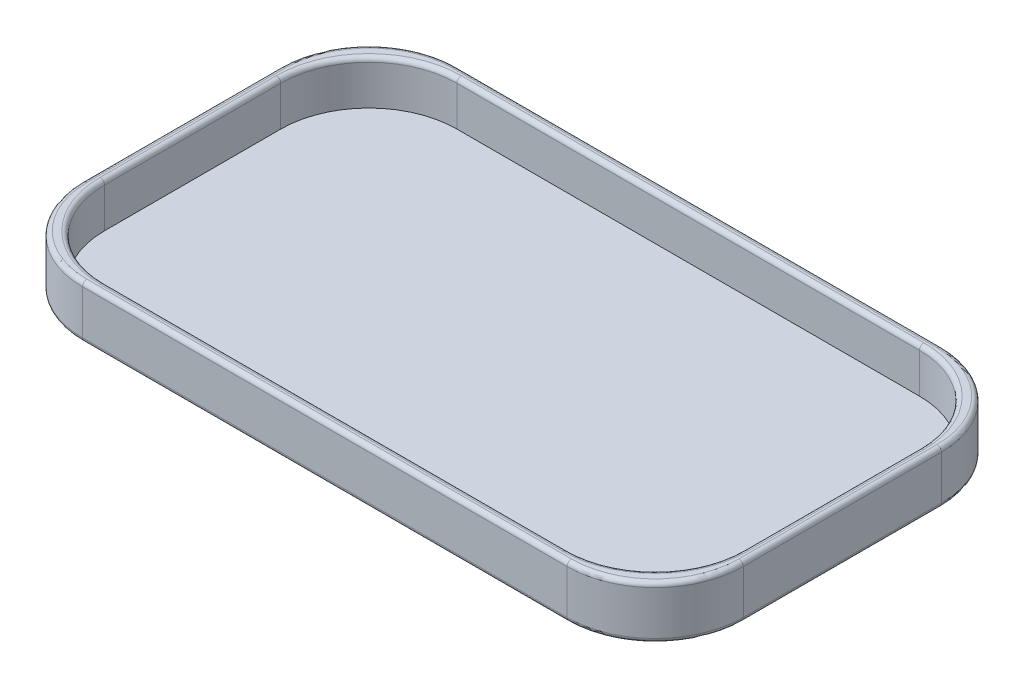
ISO-10303-21;
HEADER;
FILE_DESCRIPTION(('STEP AP214'),'2;1');
FILE_NAME('part.step','',(''),(''),'','','');
FILE_SCHEMA(('AUTOMOTIVE_DESIGN { 1 0 10303 214 1 1 1 1 }'));
ENDSEC;
DATA;
#1=APPLICATION_CONTEXT('core data for automotive mechanical design processes');
#2=APPLICATION_PROTOCOL_DEFINITION('international standard','automotive_design',2000,#1);
#3=PRODUCT_CONTEXT('',#1,'mechanical');
#4=PRODUCT('Part','Part','',(#3));
#5=PRODUCT_RELATED_PRODUCT_CATEGORY('part','',(#4));
#6=PRODUCT_DEFINITION_FORMATION('','',#4);
#7=PRODUCT_DEFINITION_CONTEXT('part definition',#1,'design');
#8=PRODUCT_DEFINITION('design','',#6,#7);
#9=PRODUCT_DEFINITION_SHAPE('','',#8);
#10=(LENGTH_UNIT() NAMED_UNIT(*) SI_UNIT(.MILLI.,.METRE.));
#11=(NAMED_UNIT(*) PLANE_ANGLE_UNIT() SI_UNIT($,.RADIAN.));
#12=(NAMED_UNIT(*) SI_UNIT($,.STERADIAN.) SOLID_ANGLE_UNIT());
#13=UNCERTAINTY_MEASURE_WITH_UNIT(LENGTH_MEASURE(1.E-05),#10,'distance_accuracy_value','');
#14=(GEOMETRIC_REPRESENTATION_CONTEXT(3) GLOBAL_UNCERTAINTY_ASSIGNED_CONTEXT((#13)) GLOBAL_UNIT_ASSIGNED_CONTEXT((#10,
#11,#12)) REPRESENTATION_CONTEXT('',''));
#15=CARTESIAN_POINT('',(0.,0.,0.));
#16=DIRECTION('',(0.,0.,1.));
#17=DIRECTION('',(1.,0.,0.));
#18=AXIS2_PLACEMENT_3D('',#15,#16,#17);
#19=CARTESIAN_POINT('',(75.,2.,42.5));
#20=DIRECTION('',(-1.,0.,0.));
#21=DIRECTION('',(0.,0.,1.));
#22=AXIS2_PLACEMENT_3D('',#19,#20,#21);
#23=PLANE('',#22);
#24=DIRECTION('',(0.,-1.,0.));
#25=VECTOR('',#24,1.);
#26=CARTESIAN_POINT('',(75.,2.,22.5));
#27=LINE('',#26,#25);
#28=CARTESIAN_POINT('',(75.,11.,22.5));
#29=VERTEX_POINT('',#28);
#30=CARTESIAN_POINT('',(75.,1.,22.5));
#31=VERTEX_POINT('',#30);
#32=EDGE_CURVE('E459',#29,#31,#27,.T.);
#33=ORIENTED_EDGE('',*,*,#32,.T.);
#34=DIRECTION('',(0.,0.,-1.));
#35=VECTOR('',#34,1.);
#36=CARTESIAN_POINT('',(75.,1.,-22.5));
#37=LINE('',#36,#35);
#38=CARTESIAN_POINT('',(75.,1.,-22.5));
#39=VERTEX_POINT('',#38);
#40=EDGE_CURVE('E312',#31,#39,#37,.T.);
#41=ORIENTED_EDGE('',*,*,#40,.T.);
#42=DIRECTION('',(0.,-1.,0.));
#43=VECTOR('',#42,1.);
#44=CARTESIAN_POINT('',(75.,2.,-22.5));
#45=LINE('',#44,#43);
#46=CARTESIAN_POINT('',(75.,11.,-22.5));
#47=VERTEX_POINT('',#46);
#48=EDGE_CURVE('E466',#39,#47,#45,.F.);
#49=ORIENTED_EDGE('',*,*,#48,.T.);
#50=DIRECTION('',(0.,0.,-1.));
#51=VECTOR('',#50,1.);
#52=CARTESIAN_POINT('',(75.,11.,42.5));
#53=LINE('',#52,#51);
#54=EDGE_CURVE('E310',#47,#29,#53,.F.);
#55=ORIENTED_EDGE('',*,*,#54,.T.);
#56=EDGE_LOOP('',(#33,#41,#49,#55));
#57=FACE_BOUND('',#56,.T.);
#58=ADVANCED_FACE('F33',(#57),#23,.F.);
#59=CARTESIAN_POINT('',(-75.,2.,-42.5));
#60=DIRECTION('',(0.,0.,1.));
#61=DIRECTION('',(1.,0.,0.));
#62=AXIS2_PLACEMENT_3D('',#59,#60,#61);
#63=PLANE('',#62);
#64=DIRECTION('',(0.,-1.,0.));
#65=VECTOR('',#64,1.);
#66=CARTESIAN_POINT('',(55.,2.,-42.5));
#67=LINE('',#66,#65);
#68=CARTESIAN_POINT('',(55.,11.,-42.5));
#69=VERTEX_POINT('',#68);
#70=CARTESIAN_POINT('',(55.,1.,-42.5));
#71=VERTEX_POINT('',#70);
#72=EDGE_CURVE('E457',#69,#71,#67,.T.);
#73=ORIENTED_EDGE('',*,*,#72,.T.);
#74=DIRECTION('',(-1.,0.,0.));
#75=VECTOR('',#74,1.);
#76=CARTESIAN_POINT('',(-55.,1.,-42.5));
#77=LINE('',#76,#75);
#78=CARTESIAN_POINT('',(-55.,1.,-42.5));
#79=VERTEX_POINT('',#78);
#80=EDGE_CURVE('E320',#71,#79,#77,.T.);
#81=ORIENTED_EDGE('',*,*,#80,.T.);
#82=DIRECTION('',(0.,-1.,0.));
#83=VECTOR('',#82,1.);
#84=CARTESIAN_POINT('',(-55.,2.,-42.5));
#85=LINE('',#84,#83);
#86=CARTESIAN_POINT('',(-55.,11.,-42.5));
#87=VERTEX_POINT('',#86);
#88=EDGE_CURVE('E449',#79,#87,#85,.F.);
#89=ORIENTED_EDGE('',*,*,#88,.T.);
#90=DIRECTION('',(-1.,0.,0.));
#91=VECTOR('',#90,1.);
#92=CARTESIAN_POINT('',(-75.,11.,-42.5));
#93=LINE('',#92,#91);
#94=EDGE_CURVE('E318',#87,#69,#93,.F.);
#95=ORIENTED_EDGE('',*,*,#94,.T.);
#96=EDGE_LOOP('',(#73,#81,#89,#95));
#97=FACE_BOUND('',#96,.T.);
#98=ADVANCED_FACE('F454',(#97),#63,.F.);
#99=CARTESIAN_POINT('',(-75.,2.,42.5));
#100=DIRECTION('',(1.,0.,0.));
#101=DIRECTION('',(0.,0.,-1.));
#102=AXIS2_PLACEMENT_3D('',#99,#100,#101);
#103=PLANE('',#102);
#104=DIRECTION('',(0.,-1.,0.));
#105=VECTOR('',#104,1.);
#106=CARTESIAN_POINT('',(-75.,2.,-22.5));
#107=LINE('',#106,#105);
#108=CARTESIAN_POINT('',(-75.,11.,-22.5));
#109=VERTEX_POINT('',#108);
#110=CARTESIAN_POINT('',(-75.,1.,-22.5));
#111=VERTEX_POINT('',#110);
#112=EDGE_CURVE('E249',#109,#111,#107,.T.);
#113=ORIENTED_EDGE('',*,*,#112,.T.);
#114=DIRECTION('',(0.,0.,1.));
#115=VECTOR('',#114,1.);
#116=CARTESIAN_POINT('',(-75.,1.,22.5));
#117=LINE('',#116,#115);
#118=CARTESIAN_POINT('',(-75.,1.,22.5));
#119=VERTEX_POINT('',#118);
#120=EDGE_CURVE('E295',#111,#119,#117,.T.);
#121=ORIENTED_EDGE('',*,*,#120,.T.);
#122=DIRECTION('',(0.,-1.,0.));
#123=VECTOR('',#122,1.);
#124=CARTESIAN_POINT('',(-75.,2.,22.5));
#125=LINE('',#124,#123);
#126=CARTESIAN_POINT('',(-75.,11.,22.5));
#127=VERTEX_POINT('',#126);
#128=EDGE_CURVE('E245',#119,#127,#125,.F.);
#129=ORIENTED_EDGE('',*,*,#128,.T.);
#130=DIRECTION('',(0.,0.,1.));
#131=VECTOR('',#130,1.);
#132=CARTESIAN_POINT('',(-75.,11.,42.5));
#133=LINE('',#132,#131);
#134=EDGE_CURVE('E293',#127,#109,#133,.F.);
#135=ORIENTED_EDGE('',*,*,#134,.T.);
#136=EDGE_LOOP('',(#113,#121,#129,#135));
#137=FACE_BOUND('',#136,.T.);
#138=ADVANCED_FACE('F475',(#137),#103,.F.);
#139=CARTESIAN_POINT('',(-75.,2.,42.5));
#140=DIRECTION('',(0.,0.,-1.));
#141=DIRECTION('',(-1.,0.,0.));
#142=AXIS2_PLACEMENT_3D('',#139,#140,#141);
#143=PLANE('',#142);
#144=DIRECTION('',(0.,-1.,0.));
#145=VECTOR('',#144,1.);
#146=CARTESIAN_POINT('',(-55.,2.,42.5));
#147=LINE('',#146,#145);
#148=CARTESIAN_POINT('',(-55.,11.,42.5));
#149=VERTEX_POINT('',#148);
#150=CARTESIAN_POINT('',(-55.,1.,42.5));
#151=VERTEX_POINT('',#150);
#152=EDGE_CURVE('E469',#149,#151,#147,.T.);
#153=ORIENTED_EDGE('',*,*,#152,.T.);
#154=DIRECTION('',(1.,0.,0.));
#155=VECTOR('',#154,1.);
#156=CARTESIAN_POINT('',(55.,1.,42.5));
#157=LINE('',#156,#155);
#158=CARTESIAN_POINT('',(55.,1.,42.5));
#159=VERTEX_POINT('',#158);
#160=EDGE_CURVE('E303',#151,#159,#157,.T.);
#161=ORIENTED_EDGE('',*,*,#160,.T.);
#162=DIRECTION('',(0.,-1.,0.));
#163=VECTOR('',#162,1.);
#164=CARTESIAN_POINT('',(55.,2.,42.5));
#165=LINE('',#164,#163);
#166=CARTESIAN_POINT('',(55.,11.,42.5));
#167=VERTEX_POINT('',#166);
#168=EDGE_CURVE('E472',#159,#167,#165,.F.);
#169=ORIENTED_EDGE('',*,*,#168,.T.);
#170=DIRECTION('',(1.,0.,0.));
#171=VECTOR('',#170,1.);
#172=CARTESIAN_POINT('',(-75.,11.,42.5));
#173=LINE('',#172,#171);
#174=EDGE_CURVE('E301',#167,#149,#173,.F.);
#175=ORIENTED_EDGE('',*,*,#174,.T.);
#176=EDGE_LOOP('',(#153,#161,#169,#175));
#177=FACE_BOUND('',#176,.T.);
#178=ADVANCED_FACE('F503',(#177),#143,.F.);
#179=CARTESIAN_POINT('',(0.,0.,0.));
#180=DIRECTION('',(0.,-1.,0.));
#181=DIRECTION('',(0.,0.,-1.));
#182=AXIS2_PLACEMENT_3D('',#179,#180,#181);
#183=PLANE('',#182);
#184=DIRECTION('',(0.,0.,1.));
#185=VECTOR('',#184,1.);
#186=CARTESIAN_POINT('',(-74.,0.,-22.5));
#187=LINE('',#186,#185);
#188=CARTESIAN_POINT('',(-74.,0.,22.5));
#189=VERTEX_POINT('',#188);
#190=CARTESIAN_POINT('',(-74.,0.,-22.5));
#191=VERTEX_POINT('',#190);
#192=EDGE_CURVE('E283',#189,#191,#187,.F.);
#193=ORIENTED_EDGE('',*,*,#192,.T.);
#194=CARTESIAN_POINT('',(-55.,0.,-22.5));
#195=DIRECTION('',(0.,-1.,0.));
#196=DIRECTION('',(0.,0.,-1.));
#197=AXIS2_PLACEMENT_3D('',#194,#195,#196);
#198=CIRCLE('',#197,19.);
#199=CARTESIAN_POINT('',(-55.,0.,-41.5));
#200=VERTEX_POINT('',#199);
#201=EDGE_CURVE('E285',#191,#200,#198,.T.);
#202=ORIENTED_EDGE('',*,*,#201,.T.);
#203=DIRECTION('',(-1.,0.,0.));
#204=VECTOR('',#203,1.);
#205=CARTESIAN_POINT('',(55.,0.,-41.5));
#206=LINE('',#205,#204);
#207=CARTESIAN_POINT('',(55.,0.,-41.5));
#208=VERTEX_POINT('',#207);
#209=EDGE_CURVE('E271',#200,#208,#206,.F.);
#210=ORIENTED_EDGE('',*,*,#209,.T.);
#211=CARTESIAN_POINT('',(55.,0.,-22.5));
#212=DIRECTION('',(0.,-1.,0.));
#213=DIRECTION('',(0.,0.,-1.));
#214=AXIS2_PLACEMENT_3D('',#211,#212,#213);
#215=CIRCLE('',#214,19.);
#216=CARTESIAN_POINT('',(74.,0.,-22.5));
#217=VERTEX_POINT('',#216);
#218=EDGE_CURVE('E273',#208,#217,#215,.T.);
#219=ORIENTED_EDGE('',*,*,#218,.T.);
#220=DIRECTION('',(0.,0.,-1.));
#221=VECTOR('',#220,1.);
#222=CARTESIAN_POINT('',(74.,0.,22.5));
#223=LINE('',#222,#221);
#224=CARTESIAN_POINT('',(74.,0.,22.5));
#225=VERTEX_POINT('',#224);
#226=EDGE_CURVE('E275',#217,#225,#223,.F.);
#227=ORIENTED_EDGE('',*,*,#226,.T.);
#228=CARTESIAN_POINT('',(55.,0.,22.5));
#229=DIRECTION('',(0.,-1.,0.));
#230=DIRECTION('',(0.,0.,-1.));
#231=AXIS2_PLACEMENT_3D('',#228,#229,#230);
#232=CIRCLE('',#231,19.);
#233=CARTESIAN_POINT('',(55.,0.,41.5));
#234=VERTEX_POINT('',#233);
#235=EDGE_CURVE('E277',#225,#234,#232,.T.);
#236=ORIENTED_EDGE('',*,*,#235,.T.);
#237=DIRECTION('',(1.,0.,0.));
#238=VECTOR('',#237,1.);
#239=CARTESIAN_POINT('',(-55.,0.,41.5));
#240=LINE('',#239,#238);
#241=CARTESIAN_POINT('',(-55.,0.,41.5));
#242=VERTEX_POINT('',#241);
#243=EDGE_CURVE('E279',#234,#242,#240,.F.);
#244=ORIENTED_EDGE('',*,*,#243,.T.);
#245=CARTESIAN_POINT('',(-55.,0.,22.5));
#246=DIRECTION('',(0.,-1.,0.));
#247=DIRECTION('',(0.,0.,-1.));
#248=AXIS2_PLACEMENT_3D('',#245,#246,#247);
#249=CIRCLE('',#248,19.);
#250=EDGE_CURVE('E281',#242,#189,#249,.T.);
#251=ORIENTED_EDGE('',*,*,#250,.T.);
#252=EDGE_LOOP('',(#193,#202,#210,#219,#227,#236,#244,#251));
#253=FACE_BOUND('',#252,.T.);
#254=ADVANCED_FACE('F494',(#253),#183,.T.);
#255=CARTESIAN_POINT('',(0.,12.,0.));
#256=DIRECTION('',(0.,-1.,0.));
#257=DIRECTION('',(0.,0.,-1.));
#258=AXIS2_PLACEMENT_3D('',#255,#256,#257);
#259=PLANE('',#258);
#260=DIRECTION('',(-1.,0.,0.));
#261=VECTOR('',#260,1.);
#262=CARTESIAN_POINT('',(52.5,12.,-41.));
#263=LINE('',#262,#261);
#264=CARTESIAN_POINT('',(-52.5,12.,-41.));
#265=VERTEX_POINT('',#264);
#266=CARTESIAN_POINT('',(52.5,12.,-41.));
#267=VERTEX_POINT('',#266);
#268=EDGE_CURVE('E351',#265,#267,#263,.F.);
#269=ORIENTED_EDGE('',*,*,#268,.T.);
#270=CARTESIAN_POINT('',(52.5,12.,-20.));
#271=DIRECTION('',(0.,-1.,0.));
#272=DIRECTION('',(0.,0.,-1.));
#273=AXIS2_PLACEMENT_3D('',#270,#271,#272);
#274=CIRCLE('',#273,21.);
#275=CARTESIAN_POINT('',(73.5,12.,-20.));
#276=VERTEX_POINT('',#275);
#277=EDGE_CURVE('E353',#267,#276,#274,.T.);
#278=ORIENTED_EDGE('',*,*,#277,.T.);
#279=DIRECTION('',(0.,0.,-1.));
#280=VECTOR('',#279,1.);
#281=CARTESIAN_POINT('',(73.5,12.,20.));
#282=LINE('',#281,#280);
#283=CARTESIAN_POINT('',(73.5,12.,20.));
#284=VERTEX_POINT('',#283);
#285=EDGE_CURVE('E339',#276,#284,#282,.F.);
#286=ORIENTED_EDGE('',*,*,#285,.T.);
#287=CARTESIAN_POINT('',(52.5,12.,20.));
#288=DIRECTION('',(0.,-1.,0.));
#289=DIRECTION('',(0.,0.,-1.));
#290=AXIS2_PLACEMENT_3D('',#287,#288,#289);
#291=CIRCLE('',#290,21.);
#292=CARTESIAN_POINT('',(52.5,12.,41.));
#293=VERTEX_POINT('',#292);
#294=EDGE_CURVE('E341',#284,#293,#291,.T.);
#295=ORIENTED_EDGE('',*,*,#294,.T.);
#296=DIRECTION('',(1.,0.,0.));
#297=VECTOR('',#296,1.);
#298=CARTESIAN_POINT('',(-52.5,12.,41.));
#299=LINE('',#298,#297);
#300=CARTESIAN_POINT('',(-52.5,12.,41.));
#301=VERTEX_POINT('',#300);
#302=EDGE_CURVE('E343',#293,#301,#299,.F.);
#303=ORIENTED_EDGE('',*,*,#302,.T.);
#304=CARTESIAN_POINT('',(-52.5,12.,20.));
#305=DIRECTION('',(0.,-1.,0.));
#306=DIRECTION('',(0.,0.,-1.));
#307=AXIS2_PLACEMENT_3D('',#304,#305,#306);
#308=CIRCLE('',#307,21.);
#309=CARTESIAN_POINT('',(-73.5,12.,20.));
#310=VERTEX_POINT('',#309);
#311=EDGE_CURVE('E345',#301,#310,#308,.T.);
#312=ORIENTED_EDGE('',*,*,#311,.T.);
#313=DIRECTION('',(0.,0.,1.));
#314=VECTOR('',#313,1.);
#315=CARTESIAN_POINT('',(-73.5,12.,-20.));
#316=LINE('',#315,#314);
#317=CARTESIAN_POINT('',(-73.5,12.,-20.));
#318=VERTEX_POINT('',#317);
#319=EDGE_CURVE('E347',#310,#318,#316,.F.);
#320=ORIENTED_EDGE('',*,*,#319,.T.);
#321=CARTESIAN_POINT('',(-52.5,12.,-20.));
#322=DIRECTION('',(0.,-1.,0.));
#323=DIRECTION('',(0.,0.,-1.));
#324=AXIS2_PLACEMENT_3D('',#321,#322,#323);
#325=CIRCLE('',#324,21.);
#326=EDGE_CURVE('E349',#318,#265,#325,.T.);
#327=ORIENTED_EDGE('',*,*,#326,.T.);
#328=EDGE_LOOP('',(#269,#278,#286,#295,#303,#312,#320,#327));
#329=FACE_BOUND('',#328,.T.);
#330=DIRECTION('',(1.,0.,0.));
#331=VECTOR('',#330,1.);
#332=CARTESIAN_POINT('',(0.,12.,41.5));
#333=LINE('',#332,#331);
#334=CARTESIAN_POINT('',(-55.,12.,41.5));
#335=VERTEX_POINT('',#334);
#336=CARTESIAN_POINT('',(55.,12.,41.5));
#337=VERTEX_POINT('',#336);
#338=EDGE_CURVE('E334',#335,#337,#333,.T.);
#339=ORIENTED_EDGE('',*,*,#338,.T.);
#340=CARTESIAN_POINT('',(55.,12.,22.5));
#341=DIRECTION('',(0.,-1.,0.));
#342=DIRECTION('',(0.,0.,-1.));
#343=AXIS2_PLACEMENT_3D('',#340,#341,#342);
#344=CIRCLE('',#343,19.);
#345=CARTESIAN_POINT('',(74.,12.,22.5));
#346=VERTEX_POINT('',#345);
#347=EDGE_CURVE('E336',#337,#346,#344,.F.);
#348=ORIENTED_EDGE('',*,*,#347,.T.);
#349=DIRECTION('',(0.,0.,-1.));
#350=VECTOR('',#349,1.);
#351=CARTESIAN_POINT('',(74.,12.,0.));
#352=LINE('',#351,#350);
#353=CARTESIAN_POINT('',(74.,12.,-22.5));
#354=VERTEX_POINT('',#353);
#355=EDGE_CURVE('E322',#346,#354,#352,.T.);
#356=ORIENTED_EDGE('',*,*,#355,.T.);
#357=CARTESIAN_POINT('',(55.,12.,-22.5));
#358=DIRECTION('',(0.,-1.,0.));
#359=DIRECTION('',(0.,0.,-1.));
#360=AXIS2_PLACEMENT_3D('',#357,#358,#359);
#361=CIRCLE('',#360,19.);
#362=CARTESIAN_POINT('',(55.,12.,-41.5));
#363=VERTEX_POINT('',#362);
#364=EDGE_CURVE('E324',#354,#363,#361,.F.);
#365=ORIENTED_EDGE('',*,*,#364,.T.);
#366=DIRECTION('',(-1.,0.,0.));
#367=VECTOR('',#366,1.);
#368=CARTESIAN_POINT('',(0.,12.,-41.5));
#369=LINE('',#368,#367);
#370=CARTESIAN_POINT('',(-55.,12.,-41.5));
#371=VERTEX_POINT('',#370);
#372=EDGE_CURVE('E326',#363,#371,#369,.T.);
#373=ORIENTED_EDGE('',*,*,#372,.T.);
#374=CARTESIAN_POINT('',(-55.,12.,-22.5));
#375=DIRECTION('',(0.,-1.,0.));
#376=DIRECTION('',(0.,0.,-1.));
#377=AXIS2_PLACEMENT_3D('',#374,#375,#376);
#378=CIRCLE('',#377,19.);
#379=CARTESIAN_POINT('',(-74.,12.,-22.5));
#380=VERTEX_POINT('',#379);
#381=EDGE_CURVE('E328',#371,#380,#378,.F.);
#382=ORIENTED_EDGE('',*,*,#381,.T.);
#383=DIRECTION('',(0.,0.,1.));
#384=VECTOR('',#383,1.);
#385=CARTESIAN_POINT('',(-74.,12.,0.));
#386=LINE('',#385,#384);
#387=CARTESIAN_POINT('',(-74.,12.,22.5));
#388=VERTEX_POINT('',#387);
#389=EDGE_CURVE('E330',#380,#388,#386,.T.);
#390=ORIENTED_EDGE('',*,*,#389,.T.);
#391=CARTESIAN_POINT('',(-55.,12.,22.5));
#392=DIRECTION('',(0.,-1.,0.));
#393=DIRECTION('',(0.,0.,-1.));
#394=AXIS2_PLACEMENT_3D('',#391,#392,#393);
#395=CIRCLE('',#394,19.);
#396=EDGE_CURVE('E332',#388,#335,#395,.F.);
#397=ORIENTED_EDGE('',*,*,#396,.T.);
#398=EDGE_LOOP('',(#339,#348,#356,#365,#373,#382,#390,#397));
#399=FACE_BOUND('',#398,.T.);
#400=ADVANCED_FACE('F546',(#329,#399),#259,.F.);
#401=CARTESIAN_POINT('',(72.5,12.,40.));
#402=DIRECTION('',(-1.,0.,0.));
#403=DIRECTION('',(0.,0.,1.));
#404=AXIS2_PLACEMENT_3D('',#401,#402,#403);
#405=PLANE('',#404);
#406=DIRECTION('',(0.,-1.,0.));
#407=VECTOR('',#406,1.);
#408=CARTESIAN_POINT('',(72.5,12.,20.));
#409=LINE('',#408,#407);
#410=CARTESIAN_POINT('',(72.5,2.,20.));
#411=VERTEX_POINT('',#410);
#412=CARTESIAN_POINT('',(72.5,11.,20.));
#413=VERTEX_POINT('',#412);
#414=EDGE_CURVE('E264',#411,#413,#409,.F.);
#415=ORIENTED_EDGE('',*,*,#414,.T.);
#416=DIRECTION('',(0.,0.,-1.));
#417=VECTOR('',#416,1.);
#418=CARTESIAN_POINT('',(72.5,11.,-20.));
#419=LINE('',#418,#417);
#420=CARTESIAN_POINT('',(72.5,11.,-20.));
#421=VERTEX_POINT('',#420);
#422=EDGE_CURVE('E11',#413,#421,#419,.T.);
#423=ORIENTED_EDGE('',*,*,#422,.T.);
#424=DIRECTION('',(0.,-1.,0.));
#425=VECTOR('',#424,1.);
#426=CARTESIAN_POINT('',(72.5,2.,-20.));
#427=LINE('',#426,#425);
#428=CARTESIAN_POINT('',(72.5,2.,-20.));
#429=VERTEX_POINT('',#428);
#430=EDGE_CURVE('E262',#421,#429,#427,.T.);
#431=ORIENTED_EDGE('',*,*,#430,.T.);
#432=DIRECTION('',(0.,0.,-1.));
#433=VECTOR('',#432,1.);
#434=CARTESIAN_POINT('',(72.5,2.,40.));
#435=LINE('',#434,#433);
#436=EDGE_CURVE('E391',#411,#429,#435,.T.);
#437=ORIENTED_EDGE('',*,*,#436,.F.);
#438=EDGE_LOOP('',(#415,#423,#431,#437));
#439=FACE_BOUND('',#438,.T.);
#440=ADVANCED_FACE('F832',(#439),#405,.T.);
#441=CARTESIAN_POINT('',(-72.5,12.,-40.));
#442=DIRECTION('',(0.,0.,1.));
#443=DIRECTION('',(1.,0.,0.));
#444=AXIS2_PLACEMENT_3D('',#441,#442,#443);
#445=PLANE('',#444);
#446=DIRECTION('',(0.,-1.,0.));
#447=VECTOR('',#446,1.);
#448=CARTESIAN_POINT('',(52.5,12.,-40.));
#449=LINE('',#448,#447);
#450=CARTESIAN_POINT('',(52.5,2.,-40.));
#451=VERTEX_POINT('',#450);
#452=CARTESIAN_POINT('',(52.5,11.,-40.));
#453=VERTEX_POINT('',#452);
#454=EDGE_CURVE('E268',#451,#453,#449,.F.);
#455=ORIENTED_EDGE('',*,*,#454,.T.);
#456=DIRECTION('',(-1.,0.,0.));
#457=VECTOR('',#456,1.);
#458=CARTESIAN_POINT('',(-52.5,11.,-40.));
#459=LINE('',#458,#457);
#460=CARTESIAN_POINT('',(-52.5,11.,-40.));
#461=VERTEX_POINT('',#460);
#462=EDGE_CURVE('E359',#453,#461,#459,.T.);
#463=ORIENTED_EDGE('',*,*,#462,.T.);
#464=DIRECTION('',(0.,-1.,0.));
#465=VECTOR('',#464,1.);
#466=CARTESIAN_POINT('',(-52.5,2.,-40.));
#467=LINE('',#466,#465);
#468=CARTESIAN_POINT('',(-52.5,2.,-40.));
#469=VERTEX_POINT('',#468);
#470=EDGE_CURVE('E266',#461,#469,#467,.T.);
#471=ORIENTED_EDGE('',*,*,#470,.T.);
#472=DIRECTION('',(-1.,0.,0.));
#473=VECTOR('',#472,1.);
#474=CARTESIAN_POINT('',(-72.5,2.,-40.));
#475=LINE('',#474,#473);
#476=EDGE_CURVE('E226',#451,#469,#475,.T.);
#477=ORIENTED_EDGE('',*,*,#476,.F.);
#478=EDGE_LOOP('',(#455,#463,#471,#477));
#479=FACE_BOUND('',#478,.T.);
#480=ADVANCED_FACE('F824',(#479),#445,.T.);
#481=CARTESIAN_POINT('',(-72.5,12.,40.));
#482=DIRECTION('',(1.,0.,0.));
#483=DIRECTION('',(0.,0.,-1.));
#484=AXIS2_PLACEMENT_3D('',#481,#482,#483);
#485=PLANE('',#484);
#486=DIRECTION('',(0.,-1.,0.));
#487=VECTOR('',#486,1.);
#488=CARTESIAN_POINT('',(-72.5,12.,-20.));
#489=LINE('',#488,#487);
#490=CARTESIAN_POINT('',(-72.5,2.,-20.));
#491=VERTEX_POINT('',#490);
#492=CARTESIAN_POINT('',(-72.5,11.,-20.));
#493=VERTEX_POINT('',#492);
#494=EDGE_CURVE('E236',#491,#493,#489,.F.);
#495=ORIENTED_EDGE('',*,*,#494,.T.);
#496=DIRECTION('',(0.,0.,1.));
#497=VECTOR('',#496,1.);
#498=CARTESIAN_POINT('',(-72.5,11.,20.));
#499=LINE('',#498,#497);
#500=CARTESIAN_POINT('',(-72.5,11.,20.));
#501=VERTEX_POINT('',#500);
#502=EDGE_CURVE('E362',#493,#501,#499,.T.);
#503=ORIENTED_EDGE('',*,*,#502,.T.);
#504=DIRECTION('',(0.,-1.,0.));
#505=VECTOR('',#504,1.);
#506=CARTESIAN_POINT('',(-72.5,2.,20.));
#507=LINE('',#506,#505);
#508=CARTESIAN_POINT('',(-72.5,2.,20.));
#509=VERTEX_POINT('',#508);
#510=EDGE_CURVE('E231',#501,#509,#507,.T.);
#511=ORIENTED_EDGE('',*,*,#510,.T.);
#512=DIRECTION('',(0.,0.,1.));
#513=VECTOR('',#512,1.);
#514=CARTESIAN_POINT('',(-72.5,2.,40.));
#515=LINE('',#514,#513);
#516=EDGE_CURVE('E224',#491,#509,#515,.T.);
#517=ORIENTED_EDGE('',*,*,#516,.F.);
#518=EDGE_LOOP('',(#495,#503,#511,#517));
#519=FACE_BOUND('',#518,.T.);
#520=ADVANCED_FACE('F235',(#519),#485,.T.);
#521=CARTESIAN_POINT('',(-72.5,12.,40.));
#522=DIRECTION('',(0.,0.,-1.));
#523=DIRECTION('',(-1.,0.,0.));
#524=AXIS2_PLACEMENT_3D('',#521,#522,#523);
#525=PLANE('',#524);
#526=DIRECTION('',(0.,-1.,0.));
#527=VECTOR('',#526,1.);
#528=CARTESIAN_POINT('',(-52.5,12.,40.));
#529=LINE('',#528,#527);
#530=CARTESIAN_POINT('',(-52.5,2.,40.));
#531=VERTEX_POINT('',#530);
#532=CARTESIAN_POINT('',(-52.5,11.,40.));
#533=VERTEX_POINT('',#532);
#534=EDGE_CURVE('E260',#531,#533,#529,.F.);
#535=ORIENTED_EDGE('',*,*,#534,.T.);
#536=DIRECTION('',(1.,0.,0.));
#537=VECTOR('',#536,1.);
#538=CARTESIAN_POINT('',(52.5,11.,40.));
#539=LINE('',#538,#537);
#540=CARTESIAN_POINT('',(52.5,11.,40.));
#541=VERTEX_POINT('',#540);
#542=EDGE_CURVE('E57',#533,#541,#539,.T.);
#543=ORIENTED_EDGE('',*,*,#542,.T.);
#544=DIRECTION('',(0.,-1.,0.));
#545=VECTOR('',#544,1.);
#546=CARTESIAN_POINT('',(52.5,2.,40.));
#547=LINE('',#546,#545);
#548=CARTESIAN_POINT('',(52.5,2.,40.));
#549=VERTEX_POINT('',#548);
#550=EDGE_CURVE('E258',#541,#549,#547,.T.);
#551=ORIENTED_EDGE('',*,*,#550,.T.);
#552=DIRECTION('',(1.,0.,0.));
#553=VECTOR('',#552,1.);
#554=CARTESIAN_POINT('',(-72.5,2.,40.));
#555=LINE('',#554,#553);
#556=EDGE_CURVE('E240',#531,#549,#555,.T.);
#557=ORIENTED_EDGE('',*,*,#556,.F.);
#558=EDGE_LOOP('',(#535,#543,#551,#557));
#559=FACE_BOUND('',#558,.T.);
#560=ADVANCED_FACE('F812',(#559),#525,.T.);
#561=CARTESIAN_POINT('',(0.,2.,0.));
#562=DIRECTION('',(0.,-1.,0.));
#563=DIRECTION('',(0.,0.,-1.));
#564=AXIS2_PLACEMENT_3D('',#561,#562,#563);
#565=PLANE('',#564);
#566=ORIENTED_EDGE('',*,*,#516,.T.);
#567=CARTESIAN_POINT('',(-52.5,2.,20.));
#568=DIRECTION('',(0.,-1.,0.));
#569=DIRECTION('',(0.,0.,-1.));
#570=AXIS2_PLACEMENT_3D('',#567,#568,#569);
#571=CIRCLE('',#570,20.);
#572=EDGE_CURVE('E256',#509,#531,#571,.F.);
#573=ORIENTED_EDGE('',*,*,#572,.T.);
#574=ORIENTED_EDGE('',*,*,#556,.T.);
#575=CARTESIAN_POINT('',(52.5,2.,20.));
#576=DIRECTION('',(0.,-1.,0.));
#577=DIRECTION('',(0.,0.,-1.));
#578=AXIS2_PLACEMENT_3D('',#575,#576,#577);
#579=CIRCLE('',#578,20.);
#580=EDGE_CURVE('E254',#549,#411,#579,.F.);
#581=ORIENTED_EDGE('',*,*,#580,.T.);
#582=ORIENTED_EDGE('',*,*,#436,.T.);
#583=CARTESIAN_POINT('',(52.5,2.,-20.));
#584=DIRECTION('',(0.,-1.,0.));
#585=DIRECTION('',(0.,0.,-1.));
#586=AXIS2_PLACEMENT_3D('',#583,#584,#585);
#587=CIRCLE('',#586,20.);
#588=EDGE_CURVE('E230',#429,#451,#587,.F.);
#589=ORIENTED_EDGE('',*,*,#588,.T.);
#590=ORIENTED_EDGE('',*,*,#476,.T.);
#591=CARTESIAN_POINT('',(-52.5,2.,-20.));
#592=DIRECTION('',(0.,-1.,0.));
#593=DIRECTION('',(0.,0.,-1.));
#594=AXIS2_PLACEMENT_3D('',#591,#592,#593);
#595=CIRCLE('',#594,20.);
#596=EDGE_CURVE('E221',#469,#491,#595,.F.);
#597=ORIENTED_EDGE('',*,*,#596,.T.);
#598=EDGE_LOOP('',(#566,#573,#574,#581,#582,#589,#590,#597));
#599=FACE_BOUND('',#598,.T.);
#600=ADVANCED_FACE('F223',(#599),#565,.F.);
#601=CARTESIAN_POINT('',(55.,2.,-22.5));
#602=DIRECTION('',(0.,-1.,0.));
#603=DIRECTION('',(0.,0.,-1.));
#604=AXIS2_PLACEMENT_3D('',#601,#602,#603);
#605=CYLINDRICAL_SURFACE('',#604,20.);
#606=ORIENTED_EDGE('',*,*,#48,.F.);
#607=CARTESIAN_POINT('',(55.,1.,-22.5));
#608=DIRECTION('',(0.,-1.,0.));
#609=DIRECTION('',(0.,0.,-1.));
#610=AXIS2_PLACEMENT_3D('',#607,#608,#609);
#611=CIRCLE('',#610,20.);
#612=EDGE_CURVE('E316',#39,#71,#611,.F.);
#613=ORIENTED_EDGE('',*,*,#612,.T.);
#614=ORIENTED_EDGE('',*,*,#72,.F.);
#615=CARTESIAN_POINT('',(55.,11.,-22.5));
#616=DIRECTION('',(0.,-1.,0.));
#617=DIRECTION('',(0.,0.,-1.));
#618=AXIS2_PLACEMENT_3D('',#615,#616,#617);
#619=CIRCLE('',#618,20.);
#620=EDGE_CURVE('E314',#69,#47,#619,.T.);
#621=ORIENTED_EDGE('',*,*,#620,.T.);
#622=EDGE_LOOP('',(#606,#613,#614,#621));
#623=FACE_BOUND('',#622,.T.);
#624=ADVANCED_FACE('F522',(#623),#605,.T.);
#625=CARTESIAN_POINT('',(55.,2.,22.5));
#626=DIRECTION('',(0.,-1.,0.));
#627=DIRECTION('',(0.,0.,-1.));
#628=AXIS2_PLACEMENT_3D('',#625,#626,#627);
#629=CYLINDRICAL_SURFACE('',#628,20.);
#630=ORIENTED_EDGE('',*,*,#168,.F.);
#631=CARTESIAN_POINT('',(55.,1.,22.5));
#632=DIRECTION('',(0.,-1.,0.));
#633=DIRECTION('',(0.,0.,-1.));
#634=AXIS2_PLACEMENT_3D('',#631,#632,#633);
#635=CIRCLE('',#634,20.);
#636=EDGE_CURVE('E308',#159,#31,#635,.F.);
#637=ORIENTED_EDGE('',*,*,#636,.T.);
#638=ORIENTED_EDGE('',*,*,#32,.F.);
#639=CARTESIAN_POINT('',(55.,11.,22.5));
#640=DIRECTION('',(0.,-1.,0.));
#641=DIRECTION('',(0.,0.,-1.));
#642=AXIS2_PLACEMENT_3D('',#639,#640,#641);
#643=CIRCLE('',#642,20.);
#644=EDGE_CURVE('E305',#29,#167,#643,.T.);
#645=ORIENTED_EDGE('',*,*,#644,.T.);
#646=EDGE_LOOP('',(#630,#637,#638,#645));
#647=FACE_BOUND('',#646,.T.);
#648=ADVANCED_FACE('F506',(#647),#629,.T.);
#649=CARTESIAN_POINT('',(-55.,2.,22.5));
#650=DIRECTION('',(0.,-1.,0.));
#651=DIRECTION('',(0.,0.,-1.));
#652=AXIS2_PLACEMENT_3D('',#649,#650,#651);
#653=CYLINDRICAL_SURFACE('',#652,20.);
#654=ORIENTED_EDGE('',*,*,#128,.F.);
#655=CARTESIAN_POINT('',(-55.,1.,22.5));
#656=DIRECTION('',(0.,-1.,0.));
#657=DIRECTION('',(0.,0.,-1.));
#658=AXIS2_PLACEMENT_3D('',#655,#656,#657);
#659=CIRCLE('',#658,20.);
#660=EDGE_CURVE('E299',#119,#151,#659,.F.);
#661=ORIENTED_EDGE('',*,*,#660,.T.);
#662=ORIENTED_EDGE('',*,*,#152,.F.);
#663=CARTESIAN_POINT('',(-55.,11.,22.5));
#664=DIRECTION('',(0.,-1.,0.));
#665=DIRECTION('',(0.,0.,-1.));
#666=AXIS2_PLACEMENT_3D('',#663,#664,#665);
#667=CIRCLE('',#666,20.);
#668=EDGE_CURVE('E297',#149,#127,#667,.T.);
#669=ORIENTED_EDGE('',*,*,#668,.T.);
#670=EDGE_LOOP('',(#654,#661,#662,#669));
#671=FACE_BOUND('',#670,.T.);
#672=ADVANCED_FACE('F480',(#671),#653,.T.);
#673=CARTESIAN_POINT('',(-55.,2.,-22.5));
#674=DIRECTION('',(0.,-1.,0.));
#675=DIRECTION('',(0.,0.,-1.));
#676=AXIS2_PLACEMENT_3D('',#673,#674,#675);
#677=CYLINDRICAL_SURFACE('',#676,20.);
#678=ORIENTED_EDGE('',*,*,#88,.F.);
#679=CARTESIAN_POINT('',(-55.,1.,-22.5));
#680=DIRECTION('',(0.,-1.,0.));
#681=DIRECTION('',(0.,0.,-1.));
#682=AXIS2_PLACEMENT_3D('',#679,#680,#681);
#683=CIRCLE('',#682,20.);
#684=EDGE_CURVE('E290',#79,#111,#683,.F.);
#685=ORIENTED_EDGE('',*,*,#684,.T.);
#686=ORIENTED_EDGE('',*,*,#112,.F.);
#687=CARTESIAN_POINT('',(-55.,11.,-22.5));
#688=DIRECTION('',(0.,-1.,0.));
#689=DIRECTION('',(0.,0.,-1.));
#690=AXIS2_PLACEMENT_3D('',#687,#688,#689);
#691=CIRCLE('',#690,20.);
#692=EDGE_CURVE('E288',#109,#87,#691,.T.);
#693=ORIENTED_EDGE('',*,*,#692,.T.);
#694=EDGE_LOOP('',(#678,#685,#686,#693));
#695=FACE_BOUND('',#694,.T.);
#696=ADVANCED_FACE('F448',(#695),#677,.T.);
#697=CARTESIAN_POINT('',(-52.5,12.,20.));
#698=DIRECTION('',(0.,1.,0.));
#699=DIRECTION('',(0.,0.,1.));
#700=AXIS2_PLACEMENT_3D('',#697,#698,#699);
#701=CYLINDRICAL_SURFACE('',#700,20.);
#702=ORIENTED_EDGE('',*,*,#510,.F.);
#703=CARTESIAN_POINT('',(-52.5,11.,20.));
#704=DIRECTION('',(0.,-1.,0.));
#705=DIRECTION('',(0.,0.,-1.));
#706=AXIS2_PLACEMENT_3D('',#703,#704,#705);
#707=CIRCLE('',#706,20.);
#708=EDGE_CURVE('E364',#501,#533,#707,.F.);
#709=ORIENTED_EDGE('',*,*,#708,.T.);
#710=ORIENTED_EDGE('',*,*,#534,.F.);
#711=ORIENTED_EDGE('',*,*,#572,.F.);
#712=EDGE_LOOP('',(#702,#709,#710,#711));
#713=FACE_BOUND('',#712,.T.);
#714=ADVANCED_FACE('F571',(#713),#701,.F.);
#715=CARTESIAN_POINT('',(52.5,12.,20.));
#716=DIRECTION('',(0.,1.,0.));
#717=DIRECTION('',(0.,0.,1.));
#718=AXIS2_PLACEMENT_3D('',#715,#716,#717);
#719=CYLINDRICAL_SURFACE('',#718,20.);
#720=ORIENTED_EDGE('',*,*,#550,.F.);
#721=CARTESIAN_POINT('',(52.5,11.,20.));
#722=DIRECTION('',(0.,-1.,0.));
#723=DIRECTION('',(0.,0.,-1.));
#724=AXIS2_PLACEMENT_3D('',#721,#722,#723);
#725=CIRCLE('',#724,20.);
#726=EDGE_CURVE('E42',#541,#413,#725,.F.);
#727=ORIENTED_EDGE('',*,*,#726,.T.);
#728=ORIENTED_EDGE('',*,*,#414,.F.);
#729=ORIENTED_EDGE('',*,*,#580,.F.);
#730=EDGE_LOOP('',(#720,#727,#728,#729));
#731=FACE_BOUND('',#730,.T.);
#732=ADVANCED_FACE('F574',(#731),#719,.F.);
#733=CARTESIAN_POINT('',(52.5,12.,-20.));
#734=DIRECTION('',(0.,1.,0.));
#735=DIRECTION('',(0.,0.,1.));
#736=AXIS2_PLACEMENT_3D('',#733,#734,#735);
#737=CYLINDRICAL_SURFACE('',#736,20.);
#738=ORIENTED_EDGE('',*,*,#430,.F.);
#739=CARTESIAN_POINT('',(52.5,11.,-20.));
#740=DIRECTION('',(0.,-1.,0.));
#741=DIRECTION('',(0.,0.,-1.));
#742=AXIS2_PLACEMENT_3D('',#739,#740,#741);
#743=CIRCLE('',#742,20.);
#744=EDGE_CURVE('E356',#421,#453,#743,.F.);
#745=ORIENTED_EDGE('',*,*,#744,.T.);
#746=ORIENTED_EDGE('',*,*,#454,.F.);
#747=ORIENTED_EDGE('',*,*,#588,.F.);
#748=EDGE_LOOP('',(#738,#745,#746,#747));
#749=FACE_BOUND('',#748,.T.);
#750=ADVANCED_FACE('F578',(#749),#737,.F.);
#751=CARTESIAN_POINT('',(-52.5,12.,-20.));
#752=DIRECTION('',(0.,1.,0.));
#753=DIRECTION('',(0.,0.,1.));
#754=AXIS2_PLACEMENT_3D('',#751,#752,#753);
#755=CYLINDRICAL_SURFACE('',#754,20.);
#756=ORIENTED_EDGE('',*,*,#470,.F.);
#757=CARTESIAN_POINT('',(-52.5,11.,-20.));
#758=DIRECTION('',(0.,-1.,0.));
#759=DIRECTION('',(0.,0.,-1.));
#760=AXIS2_PLACEMENT_3D('',#757,#758,#759);
#761=CIRCLE('',#760,20.);
#762=EDGE_CURVE('E244',#461,#493,#761,.F.);
#763=ORIENTED_EDGE('',*,*,#762,.T.);
#764=ORIENTED_EDGE('',*,*,#494,.F.);
#765=ORIENTED_EDGE('',*,*,#596,.F.);
#766=EDGE_LOOP('',(#756,#763,#764,#765));
#767=FACE_BOUND('',#766,.T.);
#768=ADVANCED_FACE('F242',(#767),#755,.F.);
#769=CARTESIAN_POINT('',(55.,1.,22.5));
#770=DIRECTION('',(0.,-1.,0.));
#771=DIRECTION('',(0.,0.,-1.));
#772=AXIS2_PLACEMENT_3D('',#769,#770,#771);
#773=TOROIDAL_SURFACE('',#772,19.,1.);
#774=CARTESIAN_POINT('',(74.,1.,22.5));
#775=DIRECTION('',(0.,0.,-1.));
#776=DIRECTION('',(-1.,0.,0.));
#777=AXIS2_PLACEMENT_3D('',#774,#775,#776);
#778=CIRCLE('',#777,1.);
#779=EDGE_CURVE('E385',#31,#225,#778,.T.);
#780=ORIENTED_EDGE('',*,*,#779,.F.);
#781=ORIENTED_EDGE('',*,*,#636,.F.);
#782=CARTESIAN_POINT('',(55.,1.,41.5));
#783=DIRECTION('',(-1.,0.,0.));
#784=DIRECTION('',(0.,0.,1.));
#785=AXIS2_PLACEMENT_3D('',#782,#783,#784);
#786=CIRCLE('',#785,1.);
#787=EDGE_CURVE('E388',#234,#159,#786,.T.);
#788=ORIENTED_EDGE('',*,*,#787,.F.);
#789=ORIENTED_EDGE('',*,*,#235,.F.);
#790=EDGE_LOOP('',(#780,#781,#788,#789));
#791=FACE_BOUND('',#790,.T.);
#792=ADVANCED_FACE('F511',(#791),#773,.T.);
#793=CARTESIAN_POINT('',(-75.,1.,41.5));
#794=DIRECTION('',(-1.,0.,0.));
#795=DIRECTION('',(0.,0.,1.));
#796=AXIS2_PLACEMENT_3D('',#793,#794,#795);
#797=CYLINDRICAL_SURFACE('',#796,1.);
#798=ORIENTED_EDGE('',*,*,#787,.T.);
#799=ORIENTED_EDGE('',*,*,#160,.F.);
#800=CARTESIAN_POINT('',(-55.,1.,41.5));
#801=DIRECTION('',(-1.,0.,0.));
#802=DIRECTION('',(0.,0.,1.));
#803=AXIS2_PLACEMENT_3D('',#800,#801,#802);
#804=CIRCLE('',#803,1.);
#805=EDGE_CURVE('E382',#242,#151,#804,.T.);
#806=ORIENTED_EDGE('',*,*,#805,.F.);
#807=ORIENTED_EDGE('',*,*,#243,.F.);
#808=EDGE_LOOP('',(#798,#799,#806,#807));
#809=FACE_BOUND('',#808,.T.);
#810=ADVANCED_FACE('F500',(#809),#797,.T.);
#811=CARTESIAN_POINT('',(74.,1.,42.5));
#812=DIRECTION('',(0.,0.,1.));
#813=DIRECTION('',(1.,0.,0.));
#814=AXIS2_PLACEMENT_3D('',#811,#812,#813);
#815=CYLINDRICAL_SURFACE('',#814,1.);
#816=ORIENTED_EDGE('',*,*,#779,.T.);
#817=ORIENTED_EDGE('',*,*,#226,.F.);
#818=CARTESIAN_POINT('',(74.,1.,-22.5));
#819=DIRECTION('',(0.,0.,-1.));
#820=DIRECTION('',(-1.,0.,0.));
#821=AXIS2_PLACEMENT_3D('',#818,#819,#820);
#822=CIRCLE('',#821,1.);
#823=EDGE_CURVE('E379',#39,#217,#822,.T.);
#824=ORIENTED_EDGE('',*,*,#823,.F.);
#825=ORIENTED_EDGE('',*,*,#40,.F.);
#826=EDGE_LOOP('',(#816,#817,#824,#825));
#827=FACE_BOUND('',#826,.T.);
#828=ADVANCED_FACE('F516',(#827),#815,.T.);
#829=CARTESIAN_POINT('',(-55.,1.,22.5));
#830=DIRECTION('',(0.,-1.,0.));
#831=DIRECTION('',(0.,0.,-1.));
#832=AXIS2_PLACEMENT_3D('',#829,#830,#831);
#833=TOROIDAL_SURFACE('',#832,19.,1.);
#834=ORIENTED_EDGE('',*,*,#805,.T.);
#835=ORIENTED_EDGE('',*,*,#660,.F.);
#836=CARTESIAN_POINT('',(-74.,1.,22.5));
#837=DIRECTION('',(0.,0.,-1.));
#838=DIRECTION('',(-1.,0.,0.));
#839=AXIS2_PLACEMENT_3D('',#836,#837,#838);
#840=CIRCLE('',#839,1.);
#841=EDGE_CURVE('E376',#189,#119,#840,.T.);
#842=ORIENTED_EDGE('',*,*,#841,.F.);
#843=ORIENTED_EDGE('',*,*,#250,.F.);
#844=EDGE_LOOP('',(#834,#835,#842,#843));
#845=FACE_BOUND('',#844,.T.);
#846=ADVANCED_FACE('F485',(#845),#833,.T.);
#847=CARTESIAN_POINT('',(55.,1.,-22.5));
#848=DIRECTION('',(0.,-1.,0.));
#849=DIRECTION('',(0.,0.,-1.));
#850=AXIS2_PLACEMENT_3D('',#847,#848,#849);
#851=TOROIDAL_SURFACE('',#850,19.,1.);
#852=ORIENTED_EDGE('',*,*,#823,.T.);
#853=ORIENTED_EDGE('',*,*,#218,.F.);
#854=CARTESIAN_POINT('',(55.,1.,-41.5));
#855=DIRECTION('',(-1.,0.,0.));
#856=DIRECTION('',(0.,0.,1.));
#857=AXIS2_PLACEMENT_3D('',#854,#855,#856);
#858=CIRCLE('',#857,1.);
#859=EDGE_CURVE('E373',#71,#208,#858,.T.);
#860=ORIENTED_EDGE('',*,*,#859,.F.);
#861=ORIENTED_EDGE('',*,*,#612,.F.);
#862=EDGE_LOOP('',(#852,#853,#860,#861));
#863=FACE_BOUND('',#862,.T.);
#864=ADVANCED_FACE('F595',(#863),#851,.T.);
#865=CARTESIAN_POINT('',(-74.,1.,42.5));
#866=DIRECTION('',(0.,0.,-1.));
#867=DIRECTION('',(-1.,0.,0.));
#868=AXIS2_PLACEMENT_3D('',#865,#866,#867);
#869=CYLINDRICAL_SURFACE('',#868,1.);
#870=ORIENTED_EDGE('',*,*,#841,.T.);
#871=ORIENTED_EDGE('',*,*,#120,.F.);
#872=CARTESIAN_POINT('',(-74.,1.,-22.5));
#873=DIRECTION('',(0.,0.,-1.));
#874=DIRECTION('',(-1.,0.,0.));
#875=AXIS2_PLACEMENT_3D('',#872,#873,#874);
#876=CIRCLE('',#875,1.);
#877=EDGE_CURVE('E370',#191,#111,#876,.T.);
#878=ORIENTED_EDGE('',*,*,#877,.F.);
#879=ORIENTED_EDGE('',*,*,#192,.F.);
#880=EDGE_LOOP('',(#870,#871,#878,#879));
#881=FACE_BOUND('',#880,.T.);
#882=ADVANCED_FACE('F490',(#881),#869,.T.);
#883=CARTESIAN_POINT('',(-75.,1.,-41.5));
#884=DIRECTION('',(1.,0.,0.));
#885=DIRECTION('',(0.,0.,-1.));
#886=AXIS2_PLACEMENT_3D('',#883,#884,#885);
#887=CYLINDRICAL_SURFACE('',#886,1.);
#888=ORIENTED_EDGE('',*,*,#859,.T.);
#889=ORIENTED_EDGE('',*,*,#209,.F.);
#890=CARTESIAN_POINT('',(-55.,1.,-41.5));
#891=DIRECTION('',(-1.,0.,0.));
#892=DIRECTION('',(0.,0.,1.));
#893=AXIS2_PLACEMENT_3D('',#890,#891,#892);
#894=CIRCLE('',#893,1.);
#895=EDGE_CURVE('E368',#79,#200,#894,.T.);
#896=ORIENTED_EDGE('',*,*,#895,.F.);
#897=ORIENTED_EDGE('',*,*,#80,.F.);
#898=EDGE_LOOP('',(#888,#889,#896,#897));
#899=FACE_BOUND('',#898,.T.);
#900=ADVANCED_FACE('F588',(#899),#887,.T.);
#901=CARTESIAN_POINT('',(-55.,1.,-22.5));
#902=DIRECTION('',(0.,-1.,0.));
#903=DIRECTION('',(0.,0.,-1.));
#904=AXIS2_PLACEMENT_3D('',#901,#902,#903);
#905=TOROIDAL_SURFACE('',#904,19.,1.);
#906=ORIENTED_EDGE('',*,*,#877,.T.);
#907=ORIENTED_EDGE('',*,*,#684,.F.);
#908=ORIENTED_EDGE('',*,*,#895,.T.);
#909=ORIENTED_EDGE('',*,*,#201,.F.);
#910=EDGE_LOOP('',(#906,#907,#908,#909));
#911=FACE_BOUND('',#910,.T.);
#912=ADVANCED_FACE('F584',(#911),#905,.T.);
#913=CARTESIAN_POINT('',(-52.5,11.,20.));
#914=DIRECTION('',(0.,-1.,0.));
#915=DIRECTION('',(0.,0.,-1.));
#916=AXIS2_PLACEMENT_3D('',#913,#914,#915);
#917=TOROIDAL_SURFACE('',#916,21.,1.);
#918=CARTESIAN_POINT('',(-52.5,11.,41.));
#919=DIRECTION('',(1.,0.,0.));
#920=DIRECTION('',(0.,0.,-1.));
#921=AXIS2_PLACEMENT_3D('',#918,#919,#920);
#922=CIRCLE('',#921,1.);
#923=EDGE_CURVE('E408',#533,#301,#922,.T.);
#924=ORIENTED_EDGE('',*,*,#923,.F.);
#925=ORIENTED_EDGE('',*,*,#708,.F.);
#926=CARTESIAN_POINT('',(-73.5,11.,20.));
#927=DIRECTION('',(0.,0.,-1.));
#928=DIRECTION('',(-1.,0.,0.));
#929=AXIS2_PLACEMENT_3D('',#926,#927,#928);
#930=CIRCLE('',#929,1.);
#931=EDGE_CURVE('E371',#310,#501,#930,.T.);
#932=ORIENTED_EDGE('',*,*,#931,.F.);
#933=ORIENTED_EDGE('',*,*,#311,.F.);
#934=EDGE_LOOP('',(#924,#925,#932,#933));
#935=FACE_BOUND('',#934,.T.);
#936=ADVANCED_FACE('F587',(#935),#917,.T.);
#937=CARTESIAN_POINT('',(-73.5,11.,40.));
#938=DIRECTION('',(0.,0.,-1.));
#939=DIRECTION('',(-1.,0.,0.));
#940=AXIS2_PLACEMENT_3D('',#937,#938,#939);
#941=CYLINDRICAL_SURFACE('',#940,1.);
#942=ORIENTED_EDGE('',*,*,#931,.T.);
#943=ORIENTED_EDGE('',*,*,#502,.F.);
#944=CARTESIAN_POINT('',(-73.5,11.,-20.));
#945=DIRECTION('',(0.,0.,-1.));
#946=DIRECTION('',(-1.,0.,0.));
#947=AXIS2_PLACEMENT_3D('',#944,#945,#946);
#948=CIRCLE('',#947,1.);
#949=EDGE_CURVE('E405',#318,#493,#948,.T.);
#950=ORIENTED_EDGE('',*,*,#949,.F.);
#951=ORIENTED_EDGE('',*,*,#319,.F.);
#952=EDGE_LOOP('',(#942,#943,#950,#951));
#953=FACE_BOUND('',#952,.T.);
#954=ADVANCED_FACE('F630',(#953),#941,.T.);
#955=CARTESIAN_POINT('',(-72.5,11.,41.));
#956=DIRECTION('',(-1.,0.,0.));
#957=DIRECTION('',(0.,0.,1.));
#958=AXIS2_PLACEMENT_3D('',#955,#956,#957);
#959=CYLINDRICAL_SURFACE('',#958,1.);
#960=ORIENTED_EDGE('',*,*,#923,.T.);
#961=ORIENTED_EDGE('',*,*,#302,.F.);
#962=CARTESIAN_POINT('',(52.5,11.,41.));
#963=DIRECTION('',(1.,0.,0.));
#964=DIRECTION('',(0.,0.,-1.));
#965=AXIS2_PLACEMENT_3D('',#962,#963,#964);
#966=CIRCLE('',#965,1.);
#967=EDGE_CURVE('E402',#541,#293,#966,.T.);
#968=ORIENTED_EDGE('',*,*,#967,.F.);
#969=ORIENTED_EDGE('',*,*,#542,.F.);
#970=EDGE_LOOP('',(#960,#961,#968,#969));
#971=FACE_BOUND('',#970,.T.);
#972=ADVANCED_FACE('F626',(#971),#959,.T.);
#973=CARTESIAN_POINT('',(-52.5,11.,-20.));
#974=DIRECTION('',(0.,-1.,0.));
#975=DIRECTION('',(0.,0.,-1.));
#976=AXIS2_PLACEMENT_3D('',#973,#974,#975);
#977=TOROIDAL_SURFACE('',#976,21.,1.);
#978=ORIENTED_EDGE('',*,*,#949,.T.);
#979=ORIENTED_EDGE('',*,*,#762,.F.);
#980=CARTESIAN_POINT('',(-52.5,11.,-41.));
#981=DIRECTION('',(1.,0.,0.));
#982=DIRECTION('',(0.,0.,-1.));
#983=AXIS2_PLACEMENT_3D('',#980,#981,#982);
#984=CIRCLE('',#983,1.);
#985=EDGE_CURVE('E399',#265,#461,#984,.T.);
#986=ORIENTED_EDGE('',*,*,#985,.F.);
#987=ORIENTED_EDGE('',*,*,#326,.F.);
#988=EDGE_LOOP('',(#978,#979,#986,#987));
#989=FACE_BOUND('',#988,.T.);
#990=ADVANCED_FACE('F622',(#989),#977,.T.);
#991=CARTESIAN_POINT('',(52.5,11.,20.));
#992=DIRECTION('',(0.,-1.,0.));
#993=DIRECTION('',(0.,0.,-1.));
#994=AXIS2_PLACEMENT_3D('',#991,#992,#993);
#995=TOROIDAL_SURFACE('',#994,21.,1.);
#996=ORIENTED_EDGE('',*,*,#967,.T.);
#997=ORIENTED_EDGE('',*,*,#294,.F.);
#998=CARTESIAN_POINT('',(73.5,11.,20.));
#999=DIRECTION('',(0.,0.,-1.));
#1000=DIRECTION('',(-1.,0.,0.));
#1001=AXIS2_PLACEMENT_3D('',#998,#999,#1000);
#1002=CIRCLE('',#1001,1.);
#1003=EDGE_CURVE('E396',#413,#284,#1002,.T.);
#1004=ORIENTED_EDGE('',*,*,#1003,.F.);
#1005=ORIENTED_EDGE('',*,*,#726,.F.);
#1006=EDGE_LOOP('',(#996,#997,#1004,#1005));
#1007=FACE_BOUND('',#1006,.T.);
#1008=ADVANCED_FACE('F618',(#1007),#995,.T.);
#1009=CARTESIAN_POINT('',(-72.5,11.,-41.));
#1010=DIRECTION('',(1.,0.,0.));
#1011=DIRECTION('',(0.,0.,-1.));
#1012=AXIS2_PLACEMENT_3D('',#1009,#1010,#1011);
#1013=CYLINDRICAL_SURFACE('',#1012,1.);
#1014=ORIENTED_EDGE('',*,*,#985,.T.);
#1015=ORIENTED_EDGE('',*,*,#462,.F.);
#1016=CARTESIAN_POINT('',(52.5,11.,-41.));
#1017=DIRECTION('',(1.,0.,0.));
#1018=DIRECTION('',(0.,0.,-1.));
#1019=AXIS2_PLACEMENT_3D('',#1016,#1017,#1018);
#1020=CIRCLE('',#1019,1.);
#1021=EDGE_CURVE('E394',#267,#453,#1020,.T.);
#1022=ORIENTED_EDGE('',*,*,#1021,.F.);
#1023=ORIENTED_EDGE('',*,*,#268,.F.);
#1024=EDGE_LOOP('',(#1014,#1015,#1022,#1023));
#1025=FACE_BOUND('',#1024,.T.);
#1026=ADVANCED_FACE('F614',(#1025),#1013,.T.);
#1027=CARTESIAN_POINT('',(73.5,11.,40.));
#1028=DIRECTION('',(0.,0.,1.));
#1029=DIRECTION('',(1.,0.,0.));
#1030=AXIS2_PLACEMENT_3D('',#1027,#1028,#1029);
#1031=CYLINDRICAL_SURFACE('',#1030,1.);
#1032=ORIENTED_EDGE('',*,*,#1003,.T.);
#1033=ORIENTED_EDGE('',*,*,#285,.F.);
#1034=CARTESIAN_POINT('',(73.5,11.,-20.));
#1035=DIRECTION('',(0.,0.,-1.));
#1036=DIRECTION('',(-1.,0.,0.));
#1037=AXIS2_PLACEMENT_3D('',#1034,#1035,#1036);
#1038=CIRCLE('',#1037,1.);
#1039=EDGE_CURVE('E392',#421,#276,#1038,.T.);
#1040=ORIENTED_EDGE('',*,*,#1039,.F.);
#1041=ORIENTED_EDGE('',*,*,#422,.F.);
#1042=EDGE_LOOP('',(#1032,#1033,#1040,#1041));
#1043=FACE_BOUND('',#1042,.T.);
#1044=ADVANCED_FACE('F610',(#1043),#1031,.T.);
#1045=CARTESIAN_POINT('',(52.5,11.,-20.));
#1046=DIRECTION('',(0.,-1.,0.));
#1047=DIRECTION('',(0.,0.,-1.));
#1048=AXIS2_PLACEMENT_3D('',#1045,#1046,#1047);
#1049=TOROIDAL_SURFACE('',#1048,21.,1.);
#1050=ORIENTED_EDGE('',*,*,#1021,.T.);
#1051=ORIENTED_EDGE('',*,*,#744,.F.);
#1052=ORIENTED_EDGE('',*,*,#1039,.T.);
#1053=ORIENTED_EDGE('',*,*,#277,.F.);
#1054=EDGE_LOOP('',(#1050,#1051,#1052,#1053));
#1055=FACE_BOUND('',#1054,.T.);
#1056=ADVANCED_FACE('F607',(#1055),#1049,.T.);
#1057=CARTESIAN_POINT('',(-55.,11.,-22.5));
#1058=DIRECTION('',(0.,-1.,0.));
#1059=DIRECTION('',(0.,0.,-1.));
#1060=AXIS2_PLACEMENT_3D('',#1057,#1058,#1059);
#1061=TOROIDAL_SURFACE('',#1060,19.,1.);
#1062=CARTESIAN_POINT('',(-55.,11.,-41.5));
#1063=DIRECTION('',(1.,0.,0.));
#1064=DIRECTION('',(0.,0.,-1.));
#1065=AXIS2_PLACEMENT_3D('',#1062,#1063,#1064);
#1066=CIRCLE('',#1065,1.);
#1067=EDGE_CURVE('E428',#87,#371,#1066,.T.);
#1068=ORIENTED_EDGE('',*,*,#1067,.F.);
#1069=ORIENTED_EDGE('',*,*,#692,.F.);
#1070=CARTESIAN_POINT('',(-74.,11.,-22.5));
#1071=DIRECTION('',(0.,0.,1.));
#1072=DIRECTION('',(1.,0.,0.));
#1073=AXIS2_PLACEMENT_3D('',#1070,#1071,#1072);
#1074=CIRCLE('',#1073,1.);
#1075=EDGE_CURVE('E37',#380,#109,#1074,.T.);
#1076=ORIENTED_EDGE('',*,*,#1075,.F.);
#1077=ORIENTED_EDGE('',*,*,#381,.F.);
#1078=EDGE_LOOP('',(#1068,#1069,#1076,#1077));
#1079=FACE_BOUND('',#1078,.T.);
#1080=ADVANCED_FACE('F35',(#1079),#1061,.T.);
#1081=CARTESIAN_POINT('',(-74.,11.,0.));
#1082=DIRECTION('',(0.,0.,1.));
#1083=DIRECTION('',(1.,0.,0.));
#1084=AXIS2_PLACEMENT_3D('',#1081,#1082,#1083);
#1085=CYLINDRICAL_SURFACE('',#1084,1.);
#1086=ORIENTED_EDGE('',*,*,#1075,.T.);
#1087=ORIENTED_EDGE('',*,*,#134,.F.);
#1088=CARTESIAN_POINT('',(-74.,11.,22.5));
#1089=DIRECTION('',(0.,0.,1.));
#1090=DIRECTION('',(1.,0.,0.));
#1091=AXIS2_PLACEMENT_3D('',#1088,#1089,#1090);
#1092=CIRCLE('',#1091,1.);
#1093=EDGE_CURVE('E426',#388,#127,#1092,.T.);
#1094=ORIENTED_EDGE('',*,*,#1093,.F.);
#1095=ORIENTED_EDGE('',*,*,#389,.F.);
#1096=EDGE_LOOP('',(#1086,#1087,#1094,#1095));
#1097=FACE_BOUND('',#1096,.T.);
#1098=ADVANCED_FACE('F439',(#1097),#1085,.T.);
#1099=CARTESIAN_POINT('',(0.,11.,-41.5));
#1100=DIRECTION('',(-1.,0.,0.));
#1101=DIRECTION('',(0.,0.,1.));
#1102=AXIS2_PLACEMENT_3D('',#1099,#1100,#1101);
#1103=CYLINDRICAL_SURFACE('',#1102,1.);
#1104=ORIENTED_EDGE('',*,*,#1067,.T.);
#1105=ORIENTED_EDGE('',*,*,#372,.F.);
#1106=CARTESIAN_POINT('',(55.,11.,-41.5));
#1107=DIRECTION('',(1.,0.,0.));
#1108=DIRECTION('',(0.,0.,-1.));
#1109=AXIS2_PLACEMENT_3D('',#1106,#1107,#1108);
#1110=CIRCLE('',#1109,1.);
#1111=EDGE_CURVE('E423',#69,#363,#1110,.T.);
#1112=ORIENTED_EDGE('',*,*,#1111,.F.);
#1113=ORIENTED_EDGE('',*,*,#94,.F.);
#1114=EDGE_LOOP('',(#1104,#1105,#1112,#1113));
#1115=FACE_BOUND('',#1114,.T.);
#1116=ADVANCED_FACE('F547',(#1115),#1103,.T.);
#1117=CARTESIAN_POINT('',(-55.,11.,22.5));
#1118=DIRECTION('',(0.,-1.,0.));
#1119=DIRECTION('',(0.,0.,-1.));
#1120=AXIS2_PLACEMENT_3D('',#1117,#1118,#1119);
#1121=TOROIDAL_SURFACE('',#1120,19.,1.);
#1122=ORIENTED_EDGE('',*,*,#1093,.T.);
#1123=ORIENTED_EDGE('',*,*,#668,.F.);
#1124=CARTESIAN_POINT('',(-55.,11.,41.5));
#1125=DIRECTION('',(1.,0.,0.));
#1126=DIRECTION('',(0.,0.,-1.));
#1127=AXIS2_PLACEMENT_3D('',#1124,#1125,#1126);
#1128=CIRCLE('',#1127,1.);
#1129=EDGE_CURVE('E420',#335,#149,#1128,.T.);
#1130=ORIENTED_EDGE('',*,*,#1129,.F.);
#1131=ORIENTED_EDGE('',*,*,#396,.F.);
#1132=EDGE_LOOP('',(#1122,#1123,#1130,#1131));
#1133=FACE_BOUND('',#1132,.T.);
#1134=ADVANCED_FACE('F543',(#1133),#1121,.T.);
#1135=CARTESIAN_POINT('',(55.,11.,-22.5));
#1136=DIRECTION('',(0.,-1.,0.));
#1137=DIRECTION('',(0.,0.,-1.));
#1138=AXIS2_PLACEMENT_3D('',#1135,#1136,#1137);
#1139=TOROIDAL_SURFACE('',#1138,19.,1.);
#1140=ORIENTED_EDGE('',*,*,#1111,.T.);
#1141=ORIENTED_EDGE('',*,*,#364,.F.);
#1142=CARTESIAN_POINT('',(74.,11.,-22.5));
#1143=DIRECTION('',(0.,0.,1.));
#1144=DIRECTION('',(1.,0.,0.));
#1145=AXIS2_PLACEMENT_3D('',#1142,#1143,#1144);
#1146=CIRCLE('',#1145,1.);
#1147=EDGE_CURVE('E417',#47,#354,#1146,.T.);
#1148=ORIENTED_EDGE('',*,*,#1147,.F.);
#1149=ORIENTED_EDGE('',*,*,#620,.F.);
#1150=EDGE_LOOP('',(#1140,#1141,#1148,#1149));
#1151=FACE_BOUND('',#1150,.T.);
#1152=ADVANCED_FACE('F526',(#1151),#1139,.T.);
#1153=CARTESIAN_POINT('',(0.,11.,41.5));
#1154=DIRECTION('',(1.,0.,0.));
#1155=DIRECTION('',(0.,0.,-1.));
#1156=AXIS2_PLACEMENT_3D('',#1153,#1154,#1155);
#1157=CYLINDRICAL_SURFACE('',#1156,1.);
#1158=ORIENTED_EDGE('',*,*,#1129,.T.);
#1159=ORIENTED_EDGE('',*,*,#174,.F.);
#1160=CARTESIAN_POINT('',(55.,11.,41.5));
#1161=DIRECTION('',(1.,0.,0.));
#1162=DIRECTION('',(0.,0.,-1.));
#1163=AXIS2_PLACEMENT_3D('',#1160,#1161,#1162);
#1164=CIRCLE('',#1163,1.);
#1165=EDGE_CURVE('E415',#337,#167,#1164,.T.);
#1166=ORIENTED_EDGE('',*,*,#1165,.F.);
#1167=ORIENTED_EDGE('',*,*,#338,.F.);
#1168=EDGE_LOOP('',(#1158,#1159,#1166,#1167));
#1169=FACE_BOUND('',#1168,.T.);
#1170=ADVANCED_FACE('F540',(#1169),#1157,.T.);
#1171=CARTESIAN_POINT('',(74.,11.,0.));
#1172=DIRECTION('',(0.,0.,-1.));
#1173=DIRECTION('',(-1.,0.,0.));
#1174=AXIS2_PLACEMENT_3D('',#1171,#1172,#1173);
#1175=CYLINDRICAL_SURFACE('',#1174,1.);
#1176=ORIENTED_EDGE('',*,*,#1147,.T.);
#1177=ORIENTED_EDGE('',*,*,#355,.F.);
#1178=CARTESIAN_POINT('',(74.,11.,22.5));
#1179=DIRECTION('',(0.,0.,1.));
#1180=DIRECTION('',(1.,0.,0.));
#1181=AXIS2_PLACEMENT_3D('',#1178,#1179,#1180);
#1182=CIRCLE('',#1181,1.);
#1183=EDGE_CURVE('E413',#29,#346,#1182,.T.);
#1184=ORIENTED_EDGE('',*,*,#1183,.F.);
#1185=ORIENTED_EDGE('',*,*,#54,.F.);
#1186=EDGE_LOOP('',(#1176,#1177,#1184,#1185));
#1187=FACE_BOUND('',#1186,.T.);
#1188=ADVANCED_FACE('F532',(#1187),#1175,.T.);
#1189=CARTESIAN_POINT('',(55.,11.,22.5));
#1190=DIRECTION('',(0.,-1.,0.));
#1191=DIRECTION('',(0.,0.,-1.));
#1192=AXIS2_PLACEMENT_3D('',#1189,#1190,#1191);
#1193=TOROIDAL_SURFACE('',#1192,19.,1.);
#1194=ORIENTED_EDGE('',*,*,#1165,.T.);
#1195=ORIENTED_EDGE('',*,*,#644,.F.);
#1196=ORIENTED_EDGE('',*,*,#1183,.T.);
#1197=ORIENTED_EDGE('',*,*,#347,.F.);
#1198=EDGE_LOOP('',(#1194,#1195,#1196,#1197));
#1199=FACE_BOUND('',#1198,.T.);
#1200=ADVANCED_FACE('F534',(#1199),#1193,.T.);
#1201=CLOSED_SHELL('',(#58,#98,#138,#178,#254,#400,#440,#480,#520,#560,#600,#624,#648,#672,#696,
#714,#732,#750,#768,#792,#810,#828,#846,#864,#882,#900,#912,#936,#954,#972,#990,#1008,#1026,
#1044,#1056,#1080,#1098,#1116,#1134,#1152,#1170,#1188,#1200));
#1202=MANIFOLD_SOLID_BREP('B2',#1201);
#1203=ADVANCED_BREP_SHAPE_REPRESENTATION('',(#18,#1202),#14);
#1204=SHAPE_DEFINITION_REPRESENTATION(#9,#1203);
ENDSEC;
END-ISO-10303-21;
